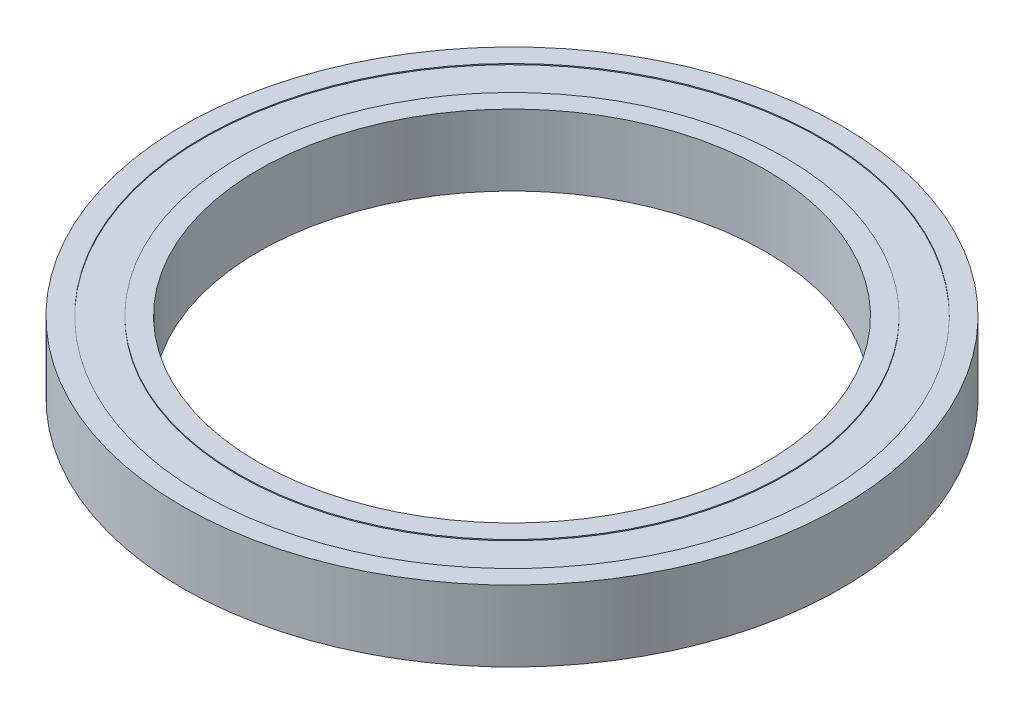
ISO-10303-21;
HEADER;
FILE_DESCRIPTION(('STEP AP214'),'2;1');
FILE_NAME('part.step','',(''),(''),'','','');
FILE_SCHEMA(('AUTOMOTIVE_DESIGN { 1 0 10303 214 1 1 1 1 }'));
ENDSEC;
DATA;
#1=APPLICATION_CONTEXT('core data for automotive mechanical design processes');
#2=APPLICATION_PROTOCOL_DEFINITION('international standard','automotive_design',2000,#1);
#3=PRODUCT_CONTEXT('',#1,'mechanical');
#4=PRODUCT('Part','Part','',(#3));
#5=PRODUCT_RELATED_PRODUCT_CATEGORY('part','',(#4));
#6=PRODUCT_DEFINITION_FORMATION('','',#4);
#7=PRODUCT_DEFINITION_CONTEXT('part definition',#1,'design');
#8=PRODUCT_DEFINITION('design','',#6,#7);
#9=PRODUCT_DEFINITION_SHAPE('','',#8);
#10=(LENGTH_UNIT() NAMED_UNIT(*) SI_UNIT(.MILLI.,.METRE.));
#11=(NAMED_UNIT(*) PLANE_ANGLE_UNIT() SI_UNIT($,.RADIAN.));
#12=(NAMED_UNIT(*) SI_UNIT($,.STERADIAN.) SOLID_ANGLE_UNIT());
#13=UNCERTAINTY_MEASURE_WITH_UNIT(LENGTH_MEASURE(1.E-05),#10,'distance_accuracy_value','');
#14=(GEOMETRIC_REPRESENTATION_CONTEXT(3) GLOBAL_UNCERTAINTY_ASSIGNED_CONTEXT((#13)) GLOBAL_UNIT_ASSIGNED_CONTEXT((#10,
#11,#12)) REPRESENTATION_CONTEXT('',''));
#15=CARTESIAN_POINT('',(0.,0.,0.));
#16=DIRECTION('',(0.,0.,1.));
#17=DIRECTION('',(1.,0.,0.));
#18=AXIS2_PLACEMENT_3D('',#15,#16,#17);
#19=CARTESIAN_POINT('',(0.,3.5,0.));
#20=DIRECTION('',(0.,-1.,0.));
#21=DIRECTION('',(0.,0.,-1.));
#22=AXIS2_PLACEMENT_3D('',#19,#20,#21);
#23=CYLINDRICAL_SURFACE('',#22,30.5);
#24=CARTESIAN_POINT('',(0.,-3.5,0.));
#25=DIRECTION('',(0.,1.,0.));
#26=DIRECTION('',(0.,0.,1.));
#27=AXIS2_PLACEMENT_3D('',#24,#25,#26);
#28=CIRCLE('',#27,30.5);
#29=CARTESIAN_POINT('',(0.,-3.5,30.5));
#30=VERTEX_POINT('',#29);
#31=EDGE_CURVE('E78',#30,#30,#28,.T.);
#32=ORIENTED_EDGE('',*,*,#31,.F.);
#33=EDGE_LOOP('',(#32));
#34=FACE_BOUND('',#33,.T.);
#35=CARTESIAN_POINT('',(0.,-3.4,0.));
#36=DIRECTION('',(0.,1.,0.));
#37=DIRECTION('',(0.,0.,1.));
#38=AXIS2_PLACEMENT_3D('',#35,#36,#37);
#39=CIRCLE('',#38,30.5);
#40=CARTESIAN_POINT('',(0.,-3.4,30.5));
#41=VERTEX_POINT('',#40);
#42=EDGE_CURVE('E113',#41,#41,#39,.T.);
#43=ORIENTED_EDGE('',*,*,#42,.T.);
#44=EDGE_LOOP('',(#43));
#45=FACE_BOUND('',#44,.T.);
#46=ADVANCED_FACE('F55',(#34,#45),#23,.F.);
#47=CARTESIAN_POINT('',(0.,3.4,0.));
#48=DIRECTION('',(0.,1.,0.));
#49=DIRECTION('',(0.,0.,1.));
#50=AXIS2_PLACEMENT_3D('',#47,#48,#49);
#51=CIRCLE('',#50,30.5);
#52=CARTESIAN_POINT('',(0.,3.4,30.5));
#53=VERTEX_POINT('',#52);
#54=EDGE_CURVE('E11',#53,#53,#51,.T.);
#55=ORIENTED_EDGE('',*,*,#54,.F.);
#56=EDGE_LOOP('',(#55));
#57=FACE_BOUND('',#56,.T.);
#58=CARTESIAN_POINT('',(0.,3.5,0.));
#59=DIRECTION('',(0.,1.,0.));
#60=DIRECTION('',(0.,0.,1.));
#61=AXIS2_PLACEMENT_3D('',#58,#59,#60);
#62=CIRCLE('',#61,30.5);
#63=CARTESIAN_POINT('',(0.,3.5,30.5));
#64=VERTEX_POINT('',#63);
#65=EDGE_CURVE('E68',#64,#64,#62,.T.);
#66=ORIENTED_EDGE('',*,*,#65,.T.);
#67=EDGE_LOOP('',(#66));
#68=FACE_BOUND('',#67,.T.);
#69=ADVANCED_FACE('F57',(#57,#68),#23,.F.);
#70=CARTESIAN_POINT('',(0.,3.5,0.));
#71=DIRECTION('',(0.,-1.,0.));
#72=DIRECTION('',(0.,0.,-1.));
#73=AXIS2_PLACEMENT_3D('',#70,#71,#72);
#74=CYLINDRICAL_SURFACE('',#73,32.5);
#75=CARTESIAN_POINT('',(0.,3.5,0.));
#76=DIRECTION('',(0.,1.,0.));
#77=DIRECTION('',(0.,0.,1.));
#78=AXIS2_PLACEMENT_3D('',#75,#76,#77);
#79=CIRCLE('',#78,32.5);
#80=CARTESIAN_POINT('',(0.,3.5,32.5));
#81=VERTEX_POINT('',#80);
#82=EDGE_CURVE('E63',#81,#81,#79,.T.);
#83=ORIENTED_EDGE('',*,*,#82,.F.);
#84=EDGE_LOOP('',(#83));
#85=FACE_BOUND('',#84,.T.);
#86=CARTESIAN_POINT('',(0.,-3.5,0.));
#87=DIRECTION('',(0.,1.,0.));
#88=DIRECTION('',(0.,0.,1.));
#89=AXIS2_PLACEMENT_3D('',#86,#87,#88);
#90=CIRCLE('',#89,32.5);
#91=CARTESIAN_POINT('',(0.,-3.5,32.5));
#92=VERTEX_POINT('',#91);
#93=EDGE_CURVE('E74',#92,#92,#90,.T.);
#94=ORIENTED_EDGE('',*,*,#93,.T.);
#95=EDGE_LOOP('',(#94));
#96=FACE_BOUND('',#95,.T.);
#97=ADVANCED_FACE('F86',(#85,#96),#74,.T.);
#98=CARTESIAN_POINT('',(0.,3.5,0.));
#99=DIRECTION('',(0.,1.,0.));
#100=DIRECTION('',(0.,0.,1.));
#101=AXIS2_PLACEMENT_3D('',#98,#99,#100);
#102=PLANE('',#101);
#103=ORIENTED_EDGE('',*,*,#65,.F.);
#104=EDGE_LOOP('',(#103));
#105=FACE_BOUND('',#104,.T.);
#106=ORIENTED_EDGE('',*,*,#82,.T.);
#107=EDGE_LOOP('',(#106));
#108=FACE_BOUND('',#107,.T.);
#109=ADVANCED_FACE('F91',(#105,#108),#102,.T.);
#110=CARTESIAN_POINT('',(0.,-3.5,0.));
#111=DIRECTION('',(0.,1.,0.));
#112=DIRECTION('',(0.,0.,1.));
#113=AXIS2_PLACEMENT_3D('',#110,#111,#112);
#114=PLANE('',#113);
#115=ORIENTED_EDGE('',*,*,#31,.T.);
#116=EDGE_LOOP('',(#115));
#117=FACE_BOUND('',#116,.T.);
#118=ORIENTED_EDGE('',*,*,#93,.F.);
#119=EDGE_LOOP('',(#118));
#120=FACE_BOUND('',#119,.T.);
#121=ADVANCED_FACE('F88',(#117,#120),#114,.F.);
#122=CARTESIAN_POINT('',(0.,3.4,0.));
#123=DIRECTION('',(0.,1.,0.));
#124=DIRECTION('',(0.,0.,1.));
#125=AXIS2_PLACEMENT_3D('',#122,#123,#124);
#126=PLANE('',#125);
#127=CARTESIAN_POINT('',(0.,3.4,0.));
#128=DIRECTION('',(0.,1.,0.));
#129=DIRECTION('',(0.,0.,1.));
#130=AXIS2_PLACEMENT_3D('',#127,#128,#129);
#131=CIRCLE('',#130,27.);
#132=CARTESIAN_POINT('',(0.,3.4,27.));
#133=VERTEX_POINT('',#132);
#134=EDGE_CURVE('E81',#133,#133,#131,.T.);
#135=ORIENTED_EDGE('',*,*,#134,.F.);
#136=EDGE_LOOP('',(#135));
#137=FACE_BOUND('',#136,.T.);
#138=ORIENTED_EDGE('',*,*,#54,.T.);
#139=EDGE_LOOP('',(#138));
#140=FACE_BOUND('',#139,.T.);
#141=ADVANCED_FACE('F90',(#137,#140),#126,.T.);
#142=CARTESIAN_POINT('',(0.,-3.4,0.));
#143=DIRECTION('',(0.,1.,0.));
#144=DIRECTION('',(0.,0.,1.));
#145=AXIS2_PLACEMENT_3D('',#142,#143,#144);
#146=PLANE('',#145);
#147=CARTESIAN_POINT('',(0.,-3.4,0.));
#148=DIRECTION('',(0.,1.,0.));
#149=DIRECTION('',(0.,0.,1.));
#150=AXIS2_PLACEMENT_3D('',#147,#148,#149);
#151=CIRCLE('',#150,27.);
#152=CARTESIAN_POINT('',(0.,-3.4,27.));
#153=VERTEX_POINT('',#152);
#154=EDGE_CURVE('E116',#153,#153,#151,.F.);
#155=ORIENTED_EDGE('',*,*,#154,.F.);
#156=EDGE_LOOP('',(#155));
#157=FACE_BOUND('',#156,.T.);
#158=ORIENTED_EDGE('',*,*,#42,.F.);
#159=EDGE_LOOP('',(#158));
#160=FACE_BOUND('',#159,.T.);
#161=ADVANCED_FACE('F99',(#157,#160),#146,.F.);
#162=CARTESIAN_POINT('',(0.,3.5,0.));
#163=DIRECTION('',(0.,-1.,0.));
#164=DIRECTION('',(0.,0.,-1.));
#165=AXIS2_PLACEMENT_3D('',#162,#163,#164);
#166=CYLINDRICAL_SURFACE('',#165,27.);
#167=CARTESIAN_POINT('',(0.,-3.5,0.));
#168=DIRECTION('',(0.,1.,0.));
#169=DIRECTION('',(0.,0.,1.));
#170=AXIS2_PLACEMENT_3D('',#167,#168,#169);
#171=CIRCLE('',#170,27.);
#172=CARTESIAN_POINT('',(0.,-3.5,27.));
#173=VERTEX_POINT('',#172);
#174=EDGE_CURVE('E125',#173,#173,#171,.T.);
#175=ORIENTED_EDGE('',*,*,#174,.T.);
#176=EDGE_LOOP('',(#175));
#177=FACE_BOUND('',#176,.T.);
#178=ORIENTED_EDGE('',*,*,#154,.T.);
#179=EDGE_LOOP('',(#178));
#180=FACE_BOUND('',#179,.T.);
#181=ADVANCED_FACE('F155',(#177,#180),#166,.T.);
#182=CARTESIAN_POINT('',(0.,3.5,0.));
#183=DIRECTION('',(0.,-1.,0.));
#184=DIRECTION('',(0.,0.,-1.));
#185=AXIS2_PLACEMENT_3D('',#182,#183,#184);
#186=CYLINDRICAL_SURFACE('',#185,25.);
#187=CARTESIAN_POINT('',(0.,3.5,0.));
#188=DIRECTION('',(0.,1.,0.));
#189=DIRECTION('',(0.,0.,1.));
#190=AXIS2_PLACEMENT_3D('',#187,#188,#189);
#191=CIRCLE('',#190,25.);
#192=CARTESIAN_POINT('',(0.,3.5,25.));
#193=VERTEX_POINT('',#192);
#194=EDGE_CURVE('E129',#193,#193,#191,.T.);
#195=ORIENTED_EDGE('',*,*,#194,.T.);
#196=EDGE_LOOP('',(#195));
#197=FACE_BOUND('',#196,.T.);
#198=CARTESIAN_POINT('',(0.,-3.5,0.));
#199=DIRECTION('',(0.,1.,0.));
#200=DIRECTION('',(0.,0.,1.));
#201=AXIS2_PLACEMENT_3D('',#198,#199,#200);
#202=CIRCLE('',#201,25.);
#203=CARTESIAN_POINT('',(0.,-3.5,25.));
#204=VERTEX_POINT('',#203);
#205=EDGE_CURVE('E130',#204,#204,#202,.T.);
#206=ORIENTED_EDGE('',*,*,#205,.F.);
#207=EDGE_LOOP('',(#206));
#208=FACE_BOUND('',#207,.T.);
#209=ADVANCED_FACE('F141',(#197,#208),#186,.F.);
#210=ORIENTED_EDGE('',*,*,#134,.T.);
#211=EDGE_LOOP('',(#210));
#212=FACE_BOUND('',#211,.T.);
#213=CARTESIAN_POINT('',(0.,3.5,0.));
#214=DIRECTION('',(0.,1.,0.));
#215=DIRECTION('',(0.,0.,1.));
#216=AXIS2_PLACEMENT_3D('',#213,#214,#215);
#217=CIRCLE('',#216,27.);
#218=CARTESIAN_POINT('',(0.,3.5,27.));
#219=VERTEX_POINT('',#218);
#220=EDGE_CURVE('E122',#219,#219,#217,.T.);
#221=ORIENTED_EDGE('',*,*,#220,.F.);
#222=EDGE_LOOP('',(#221));
#223=FACE_BOUND('',#222,.T.);
#224=ADVANCED_FACE('F148',(#212,#223),#166,.T.);
#225=CARTESIAN_POINT('',(0.,3.5,0.));
#226=DIRECTION('',(0.,1.,0.));
#227=DIRECTION('',(0.,0.,1.));
#228=AXIS2_PLACEMENT_3D('',#225,#226,#227);
#229=PLANE('',#228);
#230=ORIENTED_EDGE('',*,*,#194,.F.);
#231=EDGE_LOOP('',(#230));
#232=FACE_BOUND('',#231,.T.);
#233=ORIENTED_EDGE('',*,*,#220,.T.);
#234=EDGE_LOOP('',(#233));
#235=FACE_BOUND('',#234,.T.);
#236=ADVANCED_FACE('F144',(#232,#235),#229,.T.);
#237=CARTESIAN_POINT('',(0.,-3.5,0.));
#238=DIRECTION('',(0.,1.,0.));
#239=DIRECTION('',(0.,0.,1.));
#240=AXIS2_PLACEMENT_3D('',#237,#238,#239);
#241=PLANE('',#240);
#242=ORIENTED_EDGE('',*,*,#205,.T.);
#243=EDGE_LOOP('',(#242));
#244=FACE_BOUND('',#243,.T.);
#245=ORIENTED_EDGE('',*,*,#174,.F.);
#246=EDGE_LOOP('',(#245));
#247=FACE_BOUND('',#246,.T.);
#248=ADVANCED_FACE('F147',(#244,#247),#241,.F.);
#249=CLOSED_SHELL('',(#46,#69,#97,#109,#121,#141,#161,#181,#209,#224,#236,#248));
#250=MANIFOLD_SOLID_BREP('B2',#249);
#251=ADVANCED_BREP_SHAPE_REPRESENTATION('',(#18,#250),#14);
#252=SHAPE_DEFINITION_REPRESENTATION(#9,#251);
ENDSEC;
END-ISO-10303-21;
